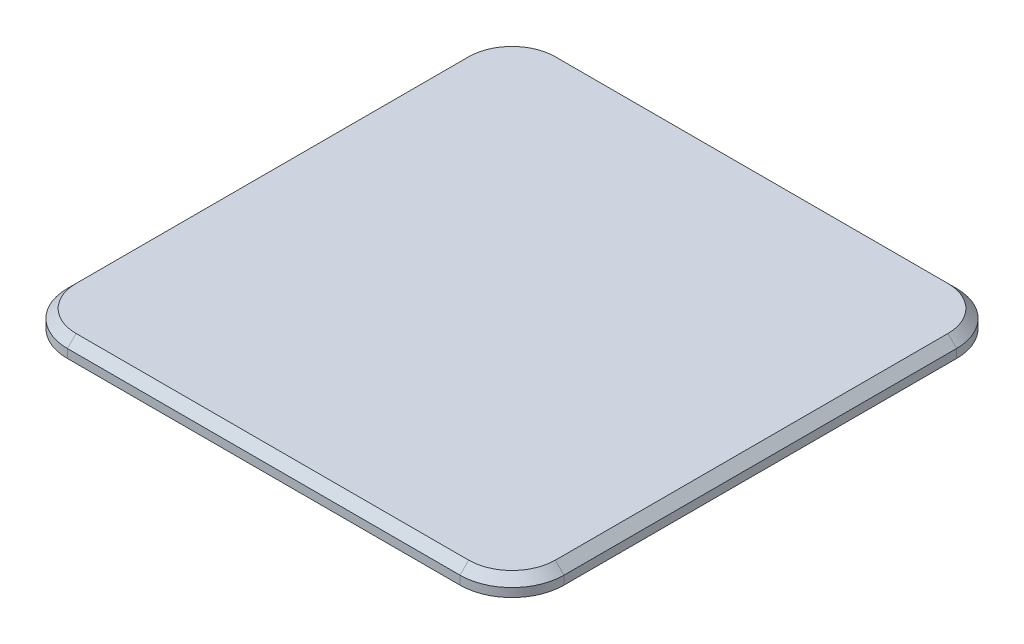
ISO-10303-21;
HEADER;
FILE_DESCRIPTION(('STEP AP214'),'2;1');
FILE_NAME('part.step','',(''),(''),'','','');
FILE_SCHEMA(('AUTOMOTIVE_DESIGN { 1 0 10303 214 1 1 1 1 }'));
ENDSEC;
DATA;
#1=APPLICATION_CONTEXT('core data for automotive mechanical design processes');
#2=APPLICATION_PROTOCOL_DEFINITION('international standard','automotive_design',2000,#1);
#3=PRODUCT_CONTEXT('',#1,'mechanical');
#4=PRODUCT('Part','Part','',(#3));
#5=PRODUCT_RELATED_PRODUCT_CATEGORY('part','',(#4));
#6=PRODUCT_DEFINITION_FORMATION('','',#4);
#7=PRODUCT_DEFINITION_CONTEXT('part definition',#1,'design');
#8=PRODUCT_DEFINITION('design','',#6,#7);
#9=PRODUCT_DEFINITION_SHAPE('','',#8);
#10=(LENGTH_UNIT() NAMED_UNIT(*) SI_UNIT(.MILLI.,.METRE.));
#11=(NAMED_UNIT(*) PLANE_ANGLE_UNIT() SI_UNIT($,.RADIAN.));
#12=(NAMED_UNIT(*) SI_UNIT($,.STERADIAN.) SOLID_ANGLE_UNIT());
#13=UNCERTAINTY_MEASURE_WITH_UNIT(LENGTH_MEASURE(1.E-05),#10,'distance_accuracy_value','');
#14=(GEOMETRIC_REPRESENTATION_CONTEXT(3) GLOBAL_UNCERTAINTY_ASSIGNED_CONTEXT((#13)) GLOBAL_UNIT_ASSIGNED_CONTEXT((#10,
#11,#12)) REPRESENTATION_CONTEXT('',''));
#15=CARTESIAN_POINT('',(0.,0.,0.));
#16=DIRECTION('',(0.,0.,1.));
#17=DIRECTION('',(1.,0.,0.));
#18=AXIS2_PLACEMENT_3D('',#15,#16,#17);
#19=CARTESIAN_POINT('',(-11.325,1.,11.325));
#20=DIRECTION('',(0.,-1.,0.));
#21=DIRECTION('',(0.,0.,-1.));
#22=AXIS2_PLACEMENT_3D('',#19,#20,#21);
#23=CYLINDRICAL_SURFACE('',#22,3.);
#24=DIRECTION('',(0.,-1.,0.));
#25=VECTOR('',#24,1.);
#26=CARTESIAN_POINT('',(-11.325,1.,14.325));
#27=LINE('',#26,#25);
#28=CARTESIAN_POINT('',(-11.325,0.499999999999994,14.325));
#29=VERTEX_POINT('',#28);
#30=CARTESIAN_POINT('',(-11.325,0.,14.325));
#31=VERTEX_POINT('',#30);
#32=EDGE_CURVE('E131',#29,#31,#27,.T.);
#33=ORIENTED_EDGE('',*,*,#32,.F.);
#34=CARTESIAN_POINT('',(-11.325,0.499999999999994,11.325));
#35=DIRECTION('',(0.,1.,0.));
#36=DIRECTION('',(0.,0.,1.));
#37=AXIS2_PLACEMENT_3D('',#34,#35,#36);
#38=CIRCLE('',#37,3.);
#39=CARTESIAN_POINT('',(-14.325,0.499999999999994,11.325));
#40=VERTEX_POINT('',#39);
#41=EDGE_CURVE('E11',#29,#40,#38,.F.);
#42=ORIENTED_EDGE('',*,*,#41,.T.);
#43=DIRECTION('',(0.,-1.,0.));
#44=VECTOR('',#43,1.);
#45=CARTESIAN_POINT('',(-14.325,1.,11.325));
#46=LINE('',#45,#44);
#47=CARTESIAN_POINT('',(-14.325,0.,11.325));
#48=VERTEX_POINT('',#47);
#49=EDGE_CURVE('E154',#40,#48,#46,.T.);
#50=ORIENTED_EDGE('',*,*,#49,.T.);
#51=CARTESIAN_POINT('',(-11.325,0.,11.325));
#52=DIRECTION('',(0.,1.,0.));
#53=DIRECTION('',(0.,0.,1.));
#54=AXIS2_PLACEMENT_3D('',#51,#52,#53);
#55=CIRCLE('',#54,3.);
#56=EDGE_CURVE('E147',#48,#31,#55,.T.);
#57=ORIENTED_EDGE('',*,*,#56,.T.);
#58=EDGE_LOOP('',(#33,#42,#50,#57));
#59=FACE_BOUND('',#58,.T.);
#60=ADVANCED_FACE('F41',(#59),#23,.T.);
#61=CARTESIAN_POINT('',(-11.325,1.,14.325));
#62=DIRECTION('',(0.,0.,-1.));
#63=DIRECTION('',(-1.,0.,0.));
#64=AXIS2_PLACEMENT_3D('',#61,#62,#63);
#65=PLANE('',#64);
#66=DIRECTION('',(0.,-1.,0.));
#67=VECTOR('',#66,1.);
#68=CARTESIAN_POINT('',(11.325,1.,14.325));
#69=LINE('',#68,#67);
#70=CARTESIAN_POINT('',(11.325,0.499999999999994,14.325));
#71=VERTEX_POINT('',#70);
#72=CARTESIAN_POINT('',(11.325,0.,14.325));
#73=VERTEX_POINT('',#72);
#74=EDGE_CURVE('E141',#71,#73,#69,.T.);
#75=ORIENTED_EDGE('',*,*,#74,.F.);
#76=DIRECTION('',(-1.,0.,0.));
#77=VECTOR('',#76,1.);
#78=CARTESIAN_POINT('',(-11.325,0.499999999999994,14.325));
#79=LINE('',#78,#77);
#80=EDGE_CURVE('E52',#71,#29,#79,.T.);
#81=ORIENTED_EDGE('',*,*,#80,.T.);
#82=ORIENTED_EDGE('',*,*,#32,.T.);
#83=DIRECTION('',(1.,0.,0.));
#84=VECTOR('',#83,1.);
#85=CARTESIAN_POINT('',(-11.325,0.,14.325));
#86=LINE('',#85,#84);
#87=EDGE_CURVE('E134',#31,#73,#86,.T.);
#88=ORIENTED_EDGE('',*,*,#87,.T.);
#89=EDGE_LOOP('',(#75,#81,#82,#88));
#90=FACE_BOUND('',#89,.T.);
#91=ADVANCED_FACE('F133',(#90),#65,.F.);
#92=CARTESIAN_POINT('',(11.325,1.,11.325));
#93=DIRECTION('',(0.,-1.,0.));
#94=DIRECTION('',(0.,0.,-1.));
#95=AXIS2_PLACEMENT_3D('',#92,#93,#94);
#96=CYLINDRICAL_SURFACE('',#95,3.);
#97=DIRECTION('',(0.,-1.,0.));
#98=VECTOR('',#97,1.);
#99=CARTESIAN_POINT('',(14.325,1.,11.325));
#100=LINE('',#99,#98);
#101=CARTESIAN_POINT('',(14.325,0.499999999999994,11.325));
#102=VERTEX_POINT('',#101);
#103=CARTESIAN_POINT('',(14.325,0.,11.325));
#104=VERTEX_POINT('',#103);
#105=EDGE_CURVE('E197',#102,#104,#100,.T.);
#106=ORIENTED_EDGE('',*,*,#105,.F.);
#107=CARTESIAN_POINT('',(11.325,0.499999999999994,11.325));
#108=DIRECTION('',(0.,1.,0.));
#109=DIRECTION('',(0.,0.,1.));
#110=AXIS2_PLACEMENT_3D('',#107,#108,#109);
#111=CIRCLE('',#110,3.);
#112=EDGE_CURVE('E67',#102,#71,#111,.F.);
#113=ORIENTED_EDGE('',*,*,#112,.T.);
#114=ORIENTED_EDGE('',*,*,#74,.T.);
#115=CARTESIAN_POINT('',(11.325,0.,11.325));
#116=DIRECTION('',(0.,1.,0.));
#117=DIRECTION('',(0.,0.,1.));
#118=AXIS2_PLACEMENT_3D('',#115,#116,#117);
#119=CIRCLE('',#118,3.);
#120=EDGE_CURVE('E150',#73,#104,#119,.T.);
#121=ORIENTED_EDGE('',*,*,#120,.T.);
#122=EDGE_LOOP('',(#106,#113,#114,#121));
#123=FACE_BOUND('',#122,.T.);
#124=ADVANCED_FACE('F324',(#123),#96,.T.);
#125=CARTESIAN_POINT('',(14.325,1.,-11.325));
#126=DIRECTION('',(-1.,0.,0.));
#127=DIRECTION('',(0.,0.,1.));
#128=AXIS2_PLACEMENT_3D('',#125,#126,#127);
#129=PLANE('',#128);
#130=DIRECTION('',(0.,-1.,0.));
#131=VECTOR('',#130,1.);
#132=CARTESIAN_POINT('',(14.325,1.,-11.325));
#133=LINE('',#132,#131);
#134=CARTESIAN_POINT('',(14.325,0.499999999999994,-11.325));
#135=VERTEX_POINT('',#134);
#136=CARTESIAN_POINT('',(14.325,0.,-11.325));
#137=VERTEX_POINT('',#136);
#138=EDGE_CURVE('E194',#135,#137,#133,.T.);
#139=ORIENTED_EDGE('',*,*,#138,.F.);
#140=DIRECTION('',(0.,0.,1.));
#141=VECTOR('',#140,1.);
#142=CARTESIAN_POINT('',(14.325,0.499999999999994,11.325));
#143=LINE('',#142,#141);
#144=EDGE_CURVE('E239',#135,#102,#143,.T.);
#145=ORIENTED_EDGE('',*,*,#144,.T.);
#146=ORIENTED_EDGE('',*,*,#105,.T.);
#147=DIRECTION('',(0.,0.,-1.));
#148=VECTOR('',#147,1.);
#149=CARTESIAN_POINT('',(14.325,0.,-11.325));
#150=LINE('',#149,#148);
#151=EDGE_CURVE('E164',#104,#137,#150,.T.);
#152=ORIENTED_EDGE('',*,*,#151,.T.);
#153=EDGE_LOOP('',(#139,#145,#146,#152));
#154=FACE_BOUND('',#153,.T.);
#155=ADVANCED_FACE('F322',(#154),#129,.F.);
#156=CARTESIAN_POINT('',(11.325,1.,-11.325));
#157=DIRECTION('',(0.,-1.,0.));
#158=DIRECTION('',(0.,0.,-1.));
#159=AXIS2_PLACEMENT_3D('',#156,#157,#158);
#160=CYLINDRICAL_SURFACE('',#159,3.);
#161=DIRECTION('',(0.,-1.,0.));
#162=VECTOR('',#161,1.);
#163=CARTESIAN_POINT('',(11.325,1.,-14.325));
#164=LINE('',#163,#162);
#165=CARTESIAN_POINT('',(11.325,0.499999999999994,-14.325));
#166=VERTEX_POINT('',#165);
#167=CARTESIAN_POINT('',(11.325,0.,-14.325));
#168=VERTEX_POINT('',#167);
#169=EDGE_CURVE('E191',#166,#168,#164,.T.);
#170=ORIENTED_EDGE('',*,*,#169,.F.);
#171=CARTESIAN_POINT('',(11.325,0.499999999999994,-11.325));
#172=DIRECTION('',(0.,1.,0.));
#173=DIRECTION('',(0.,0.,1.));
#174=AXIS2_PLACEMENT_3D('',#171,#172,#173);
#175=CIRCLE('',#174,3.);
#176=EDGE_CURVE('E236',#166,#135,#175,.F.);
#177=ORIENTED_EDGE('',*,*,#176,.T.);
#178=ORIENTED_EDGE('',*,*,#138,.T.);
#179=CARTESIAN_POINT('',(11.325,0.,-11.325));
#180=DIRECTION('',(0.,1.,0.));
#181=DIRECTION('',(0.,0.,-1.));
#182=AXIS2_PLACEMENT_3D('',#179,#180,#181);
#183=CIRCLE('',#182,3.);
#184=EDGE_CURVE('E168',#137,#168,#183,.T.);
#185=ORIENTED_EDGE('',*,*,#184,.T.);
#186=EDGE_LOOP('',(#170,#177,#178,#185));
#187=FACE_BOUND('',#186,.T.);
#188=ADVANCED_FACE('F320',(#187),#160,.T.);
#189=CARTESIAN_POINT('',(-11.325,1.,-14.325));
#190=DIRECTION('',(0.,0.,1.));
#191=DIRECTION('',(1.,0.,0.));
#192=AXIS2_PLACEMENT_3D('',#189,#190,#191);
#193=PLANE('',#192);
#194=DIRECTION('',(0.,-1.,0.));
#195=VECTOR('',#194,1.);
#196=CARTESIAN_POINT('',(-11.325,1.,-14.325));
#197=LINE('',#196,#195);
#198=CARTESIAN_POINT('',(-11.325,0.499999999999994,-14.325));
#199=VERTEX_POINT('',#198);
#200=CARTESIAN_POINT('',(-11.325,0.,-14.325));
#201=VERTEX_POINT('',#200);
#202=EDGE_CURVE('E188',#199,#201,#197,.T.);
#203=ORIENTED_EDGE('',*,*,#202,.F.);
#204=DIRECTION('',(1.,0.,0.));
#205=VECTOR('',#204,1.);
#206=CARTESIAN_POINT('',(11.325,0.499999999999994,-14.325));
#207=LINE('',#206,#205);
#208=EDGE_CURVE('E233',#199,#166,#207,.T.);
#209=ORIENTED_EDGE('',*,*,#208,.T.);
#210=ORIENTED_EDGE('',*,*,#169,.T.);
#211=DIRECTION('',(-1.,0.,0.));
#212=VECTOR('',#211,1.);
#213=CARTESIAN_POINT('',(-11.325,0.,-14.325));
#214=LINE('',#213,#212);
#215=EDGE_CURVE('E172',#168,#201,#214,.T.);
#216=ORIENTED_EDGE('',*,*,#215,.T.);
#217=EDGE_LOOP('',(#203,#209,#210,#216));
#218=FACE_BOUND('',#217,.T.);
#219=ADVANCED_FACE('F308',(#218),#193,.F.);
#220=CARTESIAN_POINT('',(-11.325,1.,-11.325));
#221=DIRECTION('',(0.,-1.,0.));
#222=DIRECTION('',(0.,0.,-1.));
#223=AXIS2_PLACEMENT_3D('',#220,#221,#222);
#224=CYLINDRICAL_SURFACE('',#223,3.);
#225=DIRECTION('',(0.,-1.,0.));
#226=VECTOR('',#225,1.);
#227=CARTESIAN_POINT('',(-14.325,1.,-11.325));
#228=LINE('',#227,#226);
#229=CARTESIAN_POINT('',(-14.325,0.499999999999994,-11.325));
#230=VERTEX_POINT('',#229);
#231=CARTESIAN_POINT('',(-14.325,0.,-11.325));
#232=VERTEX_POINT('',#231);
#233=EDGE_CURVE('E185',#230,#232,#228,.T.);
#234=ORIENTED_EDGE('',*,*,#233,.F.);
#235=CARTESIAN_POINT('',(-11.325,0.499999999999994,-11.325));
#236=DIRECTION('',(0.,1.,0.));
#237=DIRECTION('',(0.,0.,1.));
#238=AXIS2_PLACEMENT_3D('',#235,#236,#237);
#239=CIRCLE('',#238,3.);
#240=EDGE_CURVE('E230',#230,#199,#239,.F.);
#241=ORIENTED_EDGE('',*,*,#240,.T.);
#242=ORIENTED_EDGE('',*,*,#202,.T.);
#243=CARTESIAN_POINT('',(-11.325,0.,-11.325));
#244=DIRECTION('',(0.,1.,0.));
#245=DIRECTION('',(0.,0.,1.));
#246=AXIS2_PLACEMENT_3D('',#243,#244,#245);
#247=CIRCLE('',#246,3.);
#248=EDGE_CURVE('E176',#201,#232,#247,.T.);
#249=ORIENTED_EDGE('',*,*,#248,.T.);
#250=EDGE_LOOP('',(#234,#241,#242,#249));
#251=FACE_BOUND('',#250,.T.);
#252=ADVANCED_FACE('F305',(#251),#224,.T.);
#253=CARTESIAN_POINT('',(-14.325,1.,-11.325));
#254=DIRECTION('',(1.,0.,0.));
#255=DIRECTION('',(0.,0.,-1.));
#256=AXIS2_PLACEMENT_3D('',#253,#254,#255);
#257=PLANE('',#256);
#258=ORIENTED_EDGE('',*,*,#49,.F.);
#259=DIRECTION('',(0.,0.,-1.));
#260=VECTOR('',#259,1.);
#261=CARTESIAN_POINT('',(-14.325,0.499999999999994,-11.325));
#262=LINE('',#261,#260);
#263=EDGE_CURVE('E226',#40,#230,#262,.T.);
#264=ORIENTED_EDGE('',*,*,#263,.T.);
#265=ORIENTED_EDGE('',*,*,#233,.T.);
#266=DIRECTION('',(0.,0.,1.));
#267=VECTOR('',#266,1.);
#268=CARTESIAN_POINT('',(-14.325,0.,-11.325));
#269=LINE('',#268,#267);
#270=EDGE_CURVE('E180',#232,#48,#269,.T.);
#271=ORIENTED_EDGE('',*,*,#270,.T.);
#272=EDGE_LOOP('',(#258,#264,#265,#271));
#273=FACE_BOUND('',#272,.T.);
#274=ADVANCED_FACE('F292',(#273),#257,.F.);
#275=CARTESIAN_POINT('',(-11.325,1.,11.325));
#276=DIRECTION('',(0.,1.,0.));
#277=DIRECTION('',(0.,0.,1.));
#278=AXIS2_PLACEMENT_3D('',#275,#276,#277);
#279=PLANE('',#278);
#280=CARTESIAN_POINT('',(-11.325,1.,-11.325));
#281=DIRECTION('',(0.,1.,0.));
#282=DIRECTION('',(0.,0.,1.));
#283=AXIS2_PLACEMENT_3D('',#280,#281,#282);
#284=CIRCLE('',#283,2.5);
#285=CARTESIAN_POINT('',(-11.325,1.,-13.825));
#286=VERTEX_POINT('',#285);
#287=CARTESIAN_POINT('',(-13.825,1.,-11.325));
#288=VERTEX_POINT('',#287);
#289=EDGE_CURVE('E219',#286,#288,#284,.T.);
#290=ORIENTED_EDGE('',*,*,#289,.T.);
#291=DIRECTION('',(0.,0.,1.));
#292=VECTOR('',#291,1.);
#293=CARTESIAN_POINT('',(-13.825,1.,11.325));
#294=LINE('',#293,#292);
#295=CARTESIAN_POINT('',(-13.825,1.,11.325));
#296=VERTEX_POINT('',#295);
#297=EDGE_CURVE('E222',#288,#296,#294,.T.);
#298=ORIENTED_EDGE('',*,*,#297,.T.);
#299=CARTESIAN_POINT('',(-11.325,1.,11.325));
#300=DIRECTION('',(0.,1.,0.));
#301=DIRECTION('',(0.,0.,1.));
#302=AXIS2_PLACEMENT_3D('',#299,#300,#301);
#303=CIRCLE('',#302,2.5);
#304=CARTESIAN_POINT('',(-11.325,1.,13.825));
#305=VERTEX_POINT('',#304);
#306=EDGE_CURVE('E140',#296,#305,#303,.T.);
#307=ORIENTED_EDGE('',*,*,#306,.T.);
#308=DIRECTION('',(1.,0.,0.));
#309=VECTOR('',#308,1.);
#310=CARTESIAN_POINT('',(11.325,1.,13.825));
#311=LINE('',#310,#309);
#312=CARTESIAN_POINT('',(11.325,1.,13.825));
#313=VERTEX_POINT('',#312);
#314=EDGE_CURVE('E204',#305,#313,#311,.T.);
#315=ORIENTED_EDGE('',*,*,#314,.T.);
#316=CARTESIAN_POINT('',(11.325,1.,11.325));
#317=DIRECTION('',(0.,1.,0.));
#318=DIRECTION('',(0.,0.,1.));
#319=AXIS2_PLACEMENT_3D('',#316,#317,#318);
#320=CIRCLE('',#319,2.5);
#321=CARTESIAN_POINT('',(13.825,1.,11.325));
#322=VERTEX_POINT('',#321);
#323=EDGE_CURVE('E207',#313,#322,#320,.T.);
#324=ORIENTED_EDGE('',*,*,#323,.T.);
#325=DIRECTION('',(0.,0.,-1.));
#326=VECTOR('',#325,1.);
#327=CARTESIAN_POINT('',(13.825,1.,-11.325));
#328=LINE('',#327,#326);
#329=CARTESIAN_POINT('',(13.825,1.,-11.325));
#330=VERTEX_POINT('',#329);
#331=EDGE_CURVE('E210',#322,#330,#328,.T.);
#332=ORIENTED_EDGE('',*,*,#331,.T.);
#333=CARTESIAN_POINT('',(11.325,1.,-11.325));
#334=DIRECTION('',(0.,1.,0.));
#335=DIRECTION('',(0.,0.,1.));
#336=AXIS2_PLACEMENT_3D('',#333,#334,#335);
#337=CIRCLE('',#336,2.5);
#338=CARTESIAN_POINT('',(11.325,1.,-13.825));
#339=VERTEX_POINT('',#338);
#340=EDGE_CURVE('E213',#330,#339,#337,.T.);
#341=ORIENTED_EDGE('',*,*,#340,.T.);
#342=DIRECTION('',(-1.,0.,0.));
#343=VECTOR('',#342,1.);
#344=CARTESIAN_POINT('',(-11.325,1.,-13.825));
#345=LINE('',#344,#343);
#346=EDGE_CURVE('E216',#339,#286,#345,.T.);
#347=ORIENTED_EDGE('',*,*,#346,.T.);
#348=EDGE_LOOP('',(#290,#298,#307,#315,#324,#332,#341,#347));
#349=FACE_BOUND('',#348,.T.);
#350=ADVANCED_FACE('F280',(#349),#279,.T.);
#351=CARTESIAN_POINT('',(-11.325,0.,11.325));
#352=DIRECTION('',(0.,1.,0.));
#353=DIRECTION('',(0.,0.,1.));
#354=AXIS2_PLACEMENT_3D('',#351,#352,#353);
#355=PLANE('',#354);
#356=ORIENTED_EDGE('',*,*,#56,.F.);
#357=ORIENTED_EDGE('',*,*,#270,.F.);
#358=ORIENTED_EDGE('',*,*,#248,.F.);
#359=ORIENTED_EDGE('',*,*,#215,.F.);
#360=ORIENTED_EDGE('',*,*,#184,.F.);
#361=ORIENTED_EDGE('',*,*,#151,.F.);
#362=ORIENTED_EDGE('',*,*,#120,.F.);
#363=ORIENTED_EDGE('',*,*,#87,.F.);
#364=EDGE_LOOP('',(#356,#357,#358,#359,#360,#361,#362,#363));
#365=FACE_BOUND('',#364,.T.);
#366=ADVANCED_FACE('F145',(#365),#355,.F.);
#367=CARTESIAN_POINT('',(13.825,1.,11.325));
#368=DIRECTION('',(0.707106781186549,0.707106781186546,0.));
#369=DIRECTION('',(0.,0.,1.));
#370=AXIS2_PLACEMENT_3D('',#367,#368,#369);
#371=PLANE('',#370);
#372=DIRECTION('',(-0.707106781186546,0.707106781186549,0.));
#373=VECTOR('',#372,1.);
#374=CARTESIAN_POINT('',(14.325,0.499999999999994,11.325));
#375=LINE('',#374,#373);
#376=EDGE_CURVE('E160',#102,#322,#375,.T.);
#377=ORIENTED_EDGE('',*,*,#376,.F.);
#378=ORIENTED_EDGE('',*,*,#144,.F.);
#379=DIRECTION('',(0.707106781186546,-0.707106781186549,0.));
#380=VECTOR('',#379,1.);
#381=CARTESIAN_POINT('',(13.825,1.,-11.325));
#382=LINE('',#381,#380);
#383=EDGE_CURVE('E46',#330,#135,#382,.T.);
#384=ORIENTED_EDGE('',*,*,#383,.F.);
#385=ORIENTED_EDGE('',*,*,#331,.F.);
#386=EDGE_LOOP('',(#377,#378,#384,#385));
#387=FACE_BOUND('',#386,.T.);
#388=ADVANCED_FACE('F44',(#387),#371,.T.);
#389=CARTESIAN_POINT('',(11.325,1.,-11.325));
#390=DIRECTION('',(0.,-1.,0.));
#391=DIRECTION('',(0.,0.,-1.));
#392=AXIS2_PLACEMENT_3D('',#389,#390,#391);
#393=CONICAL_SURFACE('',#392,2.5,0.785398163397447);
#394=ORIENTED_EDGE('',*,*,#383,.T.);
#395=ORIENTED_EDGE('',*,*,#176,.F.);
#396=DIRECTION('',(0.,-0.707106781186549,-0.707106781186546));
#397=VECTOR('',#396,1.);
#398=CARTESIAN_POINT('',(11.325,1.,-13.825));
#399=LINE('',#398,#397);
#400=EDGE_CURVE('E264',#339,#166,#399,.T.);
#401=ORIENTED_EDGE('',*,*,#400,.F.);
#402=ORIENTED_EDGE('',*,*,#340,.F.);
#403=EDGE_LOOP('',(#394,#395,#401,#402));
#404=FACE_BOUND('',#403,.T.);
#405=ADVANCED_FACE('F317',(#404),#393,.T.);
#406=CARTESIAN_POINT('',(11.325,1.,11.325));
#407=DIRECTION('',(0.,-1.,0.));
#408=DIRECTION('',(0.,0.,-1.));
#409=AXIS2_PLACEMENT_3D('',#406,#407,#408);
#410=CONICAL_SURFACE('',#409,2.5,0.785398163397447);
#411=ORIENTED_EDGE('',*,*,#376,.T.);
#412=ORIENTED_EDGE('',*,*,#323,.F.);
#413=DIRECTION('',(0.,0.707106781186549,-0.707106781186546));
#414=VECTOR('',#413,1.);
#415=CARTESIAN_POINT('',(11.325,0.499999999999994,14.325));
#416=LINE('',#415,#414);
#417=EDGE_CURVE('E260',#71,#313,#416,.T.);
#418=ORIENTED_EDGE('',*,*,#417,.F.);
#419=ORIENTED_EDGE('',*,*,#112,.F.);
#420=EDGE_LOOP('',(#411,#412,#418,#419));
#421=FACE_BOUND('',#420,.T.);
#422=ADVANCED_FACE('F272',(#421),#410,.T.);
#423=CARTESIAN_POINT('',(-11.325,1.,-13.825));
#424=DIRECTION('',(0.,0.707106781186546,-0.707106781186549));
#425=DIRECTION('',(1.,0.,0.));
#426=AXIS2_PLACEMENT_3D('',#423,#424,#425);
#427=PLANE('',#426);
#428=ORIENTED_EDGE('',*,*,#400,.T.);
#429=ORIENTED_EDGE('',*,*,#208,.F.);
#430=DIRECTION('',(0.,-0.707106781186549,-0.707106781186546));
#431=VECTOR('',#430,1.);
#432=CARTESIAN_POINT('',(-11.325,1.,-13.825));
#433=LINE('',#432,#431);
#434=EDGE_CURVE('E256',#286,#199,#433,.T.);
#435=ORIENTED_EDGE('',*,*,#434,.F.);
#436=ORIENTED_EDGE('',*,*,#346,.F.);
#437=EDGE_LOOP('',(#428,#429,#435,#436));
#438=FACE_BOUND('',#437,.T.);
#439=ADVANCED_FACE('F313',(#438),#427,.T.);
#440=CARTESIAN_POINT('',(-11.325,1.,13.825));
#441=DIRECTION('',(0.,0.707106781186546,0.707106781186549));
#442=DIRECTION('',(-1.,0.,0.));
#443=AXIS2_PLACEMENT_3D('',#440,#441,#442);
#444=PLANE('',#443);
#445=ORIENTED_EDGE('',*,*,#417,.T.);
#446=ORIENTED_EDGE('',*,*,#314,.F.);
#447=DIRECTION('',(0.,0.707106781186549,-0.707106781186546));
#448=VECTOR('',#447,1.);
#449=CARTESIAN_POINT('',(-11.325,0.499999999999994,14.325));
#450=LINE('',#449,#448);
#451=EDGE_CURVE('E252',#29,#305,#450,.T.);
#452=ORIENTED_EDGE('',*,*,#451,.F.);
#453=ORIENTED_EDGE('',*,*,#80,.F.);
#454=EDGE_LOOP('',(#445,#446,#452,#453));
#455=FACE_BOUND('',#454,.T.);
#456=ADVANCED_FACE('F285',(#455),#444,.T.);
#457=CARTESIAN_POINT('',(-11.325,1.,-11.325));
#458=DIRECTION('',(0.,-1.,0.));
#459=DIRECTION('',(0.,0.,-1.));
#460=AXIS2_PLACEMENT_3D('',#457,#458,#459);
#461=CONICAL_SURFACE('',#460,2.5,0.785398163397447);
#462=ORIENTED_EDGE('',*,*,#434,.T.);
#463=ORIENTED_EDGE('',*,*,#240,.F.);
#464=DIRECTION('',(-0.707106781186546,-0.707106781186549,0.));
#465=VECTOR('',#464,1.);
#466=CARTESIAN_POINT('',(-13.825,1.,-11.325));
#467=LINE('',#466,#465);
#468=EDGE_CURVE('E249',#288,#230,#467,.T.);
#469=ORIENTED_EDGE('',*,*,#468,.F.);
#470=ORIENTED_EDGE('',*,*,#289,.F.);
#471=EDGE_LOOP('',(#462,#463,#469,#470));
#472=FACE_BOUND('',#471,.T.);
#473=ADVANCED_FACE('F301',(#472),#461,.T.);
#474=CARTESIAN_POINT('',(-11.325,1.,11.325));
#475=DIRECTION('',(0.,-1.,0.));
#476=DIRECTION('',(0.,0.,-1.));
#477=AXIS2_PLACEMENT_3D('',#474,#475,#476);
#478=CONICAL_SURFACE('',#477,2.5,0.785398163397447);
#479=ORIENTED_EDGE('',*,*,#451,.T.);
#480=ORIENTED_EDGE('',*,*,#306,.F.);
#481=DIRECTION('',(0.707106781186546,0.707106781186549,0.));
#482=VECTOR('',#481,1.);
#483=CARTESIAN_POINT('',(-14.325,0.499999999999994,11.325));
#484=LINE('',#483,#482);
#485=EDGE_CURVE('E246',#40,#296,#484,.T.);
#486=ORIENTED_EDGE('',*,*,#485,.F.);
#487=ORIENTED_EDGE('',*,*,#41,.F.);
#488=EDGE_LOOP('',(#479,#480,#486,#487));
#489=FACE_BOUND('',#488,.T.);
#490=ADVANCED_FACE('F288',(#489),#478,.T.);
#491=CARTESIAN_POINT('',(-13.825,1.,11.325));
#492=DIRECTION('',(-0.707106781186549,0.707106781186546,0.));
#493=DIRECTION('',(0.,0.,-1.));
#494=AXIS2_PLACEMENT_3D('',#491,#492,#493);
#495=PLANE('',#494);
#496=ORIENTED_EDGE('',*,*,#468,.T.);
#497=ORIENTED_EDGE('',*,*,#263,.F.);
#498=ORIENTED_EDGE('',*,*,#485,.T.);
#499=ORIENTED_EDGE('',*,*,#297,.F.);
#500=EDGE_LOOP('',(#496,#497,#498,#499));
#501=FACE_BOUND('',#500,.T.);
#502=ADVANCED_FACE('F295',(#501),#495,.T.);
#503=CLOSED_SHELL('',(#60,#91,#124,#155,#188,#219,#252,#274,#350,#366,#388,#405,#422,#439,#456,
#473,#490,#502));
#504=MANIFOLD_SOLID_BREP('B2',#503);
#505=ADVANCED_BREP_SHAPE_REPRESENTATION('',(#18,#504),#14);
#506=SHAPE_DEFINITION_REPRESENTATION(#9,#505);
ENDSEC;
END-ISO-10303-21;
